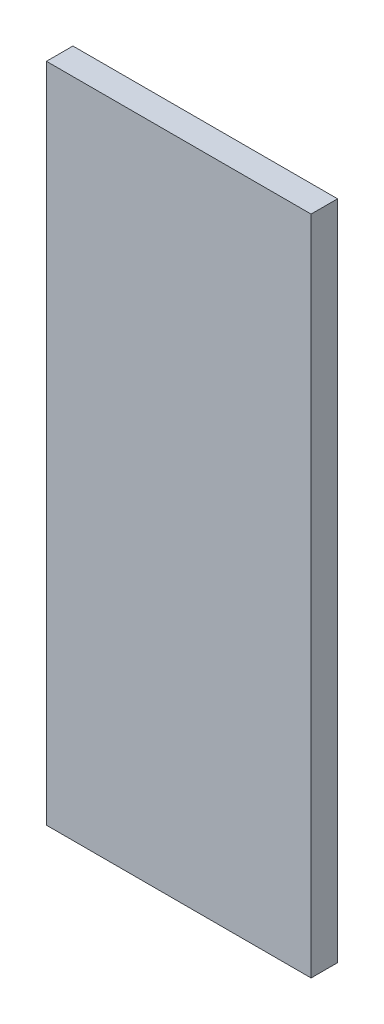
ISO-10303-21;
HEADER;
FILE_DESCRIPTION(('STEP AP214'),'2;1');
FILE_NAME('part.step','',(''),(''),'','','');
FILE_SCHEMA(('AUTOMOTIVE_DESIGN { 1 0 10303 214 1 1 1 1 }'));
ENDSEC;
DATA;
#1=APPLICATION_CONTEXT('core data for automotive mechanical design processes');
#2=APPLICATION_PROTOCOL_DEFINITION('international standard','automotive_design',2000,#1);
#3=PRODUCT_CONTEXT('',#1,'mechanical');
#4=PRODUCT('Part','Part','',(#3));
#5=PRODUCT_RELATED_PRODUCT_CATEGORY('part','',(#4));
#6=PRODUCT_DEFINITION_FORMATION('','',#4);
#7=PRODUCT_DEFINITION_CONTEXT('part definition',#1,'design');
#8=PRODUCT_DEFINITION('design','',#6,#7);
#9=PRODUCT_DEFINITION_SHAPE('','',#8);
#10=(LENGTH_UNIT() NAMED_UNIT(*) SI_UNIT(.MILLI.,.METRE.));
#11=(NAMED_UNIT(*) PLANE_ANGLE_UNIT() SI_UNIT($,.RADIAN.));
#12=(NAMED_UNIT(*) SI_UNIT($,.STERADIAN.) SOLID_ANGLE_UNIT());
#13=UNCERTAINTY_MEASURE_WITH_UNIT(LENGTH_MEASURE(1.E-05),#10,'distance_accuracy_value','');
#14=(GEOMETRIC_REPRESENTATION_CONTEXT(3) GLOBAL_UNCERTAINTY_ASSIGNED_CONTEXT((#13)) GLOBAL_UNIT_ASSIGNED_CONTEXT((#10,
#11,#12)) REPRESENTATION_CONTEXT('',''));
#15=CARTESIAN_POINT('',(0.,0.,0.));
#16=DIRECTION('',(0.,0.,1.));
#17=DIRECTION('',(1.,0.,0.));
#18=AXIS2_PLACEMENT_3D('',#15,#16,#17);
#19=CARTESIAN_POINT('',(6.,-15.,1.2));
#20=DIRECTION('',(-1.,0.,0.));
#21=DIRECTION('',(0.,0.,1.));
#22=AXIS2_PLACEMENT_3D('',#19,#20,#21);
#23=PLANE('',#22);
#24=DIRECTION('',(0.,1.,0.));
#25=VECTOR('',#24,1.);
#26=CARTESIAN_POINT('',(6.,-15.,0.));
#27=LINE('',#26,#25);
#28=CARTESIAN_POINT('',(6.,-15.,0.));
#29=VERTEX_POINT('',#28);
#30=CARTESIAN_POINT('',(6.,15.,0.));
#31=VERTEX_POINT('',#30);
#32=EDGE_CURVE('E123',#29,#31,#27,.T.);
#33=ORIENTED_EDGE('',*,*,#32,.T.);
#34=DIRECTION('',(0.,0.,-1.));
#35=VECTOR('',#34,1.);
#36=CARTESIAN_POINT('',(6.,15.,1.2));
#37=LINE('',#36,#35);
#38=CARTESIAN_POINT('',(6.,15.,1.2));
#39=VERTEX_POINT('',#38);
#40=EDGE_CURVE('E11',#39,#31,#37,.T.);
#41=ORIENTED_EDGE('',*,*,#40,.F.);
#42=DIRECTION('',(0.,1.,0.));
#43=VECTOR('',#42,1.);
#44=CARTESIAN_POINT('',(6.,-15.,1.2));
#45=LINE('',#44,#43);
#46=CARTESIAN_POINT('',(6.,-15.,1.2));
#47=VERTEX_POINT('',#46);
#48=EDGE_CURVE('E132',#47,#39,#45,.T.);
#49=ORIENTED_EDGE('',*,*,#48,.F.);
#50=DIRECTION('',(0.,0.,-1.));
#51=VECTOR('',#50,1.);
#52=CARTESIAN_POINT('',(6.,-15.,1.2));
#53=LINE('',#52,#51);
#54=EDGE_CURVE('E141',#47,#29,#53,.T.);
#55=ORIENTED_EDGE('',*,*,#54,.T.);
#56=EDGE_LOOP('',(#33,#41,#49,#55));
#57=FACE_BOUND('',#56,.T.);
#58=ADVANCED_FACE('F39',(#57),#23,.F.);
#59=CARTESIAN_POINT('',(-6.,15.,1.2));
#60=DIRECTION('',(0.,-1.,0.));
#61=DIRECTION('',(0.,0.,-1.));
#62=AXIS2_PLACEMENT_3D('',#59,#60,#61);
#63=PLANE('',#62);
#64=DIRECTION('',(-1.,0.,0.));
#65=VECTOR('',#64,1.);
#66=CARTESIAN_POINT('',(-6.,15.,0.));
#67=LINE('',#66,#65);
#68=CARTESIAN_POINT('',(-6.,15.,0.));
#69=VERTEX_POINT('',#68);
#70=EDGE_CURVE('E126',#31,#69,#67,.T.);
#71=ORIENTED_EDGE('',*,*,#70,.T.);
#72=DIRECTION('',(0.,0.,-1.));
#73=VECTOR('',#72,1.);
#74=CARTESIAN_POINT('',(-6.,15.,1.2));
#75=LINE('',#74,#73);
#76=CARTESIAN_POINT('',(-6.,15.,1.2));
#77=VERTEX_POINT('',#76);
#78=EDGE_CURVE('E46',#77,#69,#75,.T.);
#79=ORIENTED_EDGE('',*,*,#78,.F.);
#80=DIRECTION('',(-1.,0.,0.));
#81=VECTOR('',#80,1.);
#82=CARTESIAN_POINT('',(-6.,15.,1.2));
#83=LINE('',#82,#81);
#84=EDGE_CURVE('E135',#39,#77,#83,.T.);
#85=ORIENTED_EDGE('',*,*,#84,.F.);
#86=ORIENTED_EDGE('',*,*,#40,.T.);
#87=EDGE_LOOP('',(#71,#79,#85,#86));
#88=FACE_BOUND('',#87,.T.);
#89=ADVANCED_FACE('F172',(#88),#63,.F.);
#90=CARTESIAN_POINT('',(-6.,-15.,1.2));
#91=DIRECTION('',(1.,0.,0.));
#92=DIRECTION('',(0.,0.,-1.));
#93=AXIS2_PLACEMENT_3D('',#90,#91,#92);
#94=PLANE('',#93);
#95=DIRECTION('',(0.,-1.,0.));
#96=VECTOR('',#95,1.);
#97=CARTESIAN_POINT('',(-6.,-15.,0.));
#98=LINE('',#97,#96);
#99=CARTESIAN_POINT('',(-6.,-15.,0.));
#100=VERTEX_POINT('',#99);
#101=EDGE_CURVE('E144',#69,#100,#98,.T.);
#102=ORIENTED_EDGE('',*,*,#101,.T.);
#103=DIRECTION('',(0.,0.,-1.));
#104=VECTOR('',#103,1.);
#105=CARTESIAN_POINT('',(-6.,-15.,1.2));
#106=LINE('',#105,#104);
#107=CARTESIAN_POINT('',(-6.,-15.,1.2));
#108=VERTEX_POINT('',#107);
#109=EDGE_CURVE('E149',#108,#100,#106,.T.);
#110=ORIENTED_EDGE('',*,*,#109,.F.);
#111=DIRECTION('',(0.,-1.,0.));
#112=VECTOR('',#111,1.);
#113=CARTESIAN_POINT('',(-6.,-15.,1.2));
#114=LINE('',#113,#112);
#115=EDGE_CURVE('E138',#77,#108,#114,.T.);
#116=ORIENTED_EDGE('',*,*,#115,.F.);
#117=ORIENTED_EDGE('',*,*,#78,.T.);
#118=EDGE_LOOP('',(#102,#110,#116,#117));
#119=FACE_BOUND('',#118,.T.);
#120=ADVANCED_FACE('F156',(#119),#94,.F.);
#121=CARTESIAN_POINT('',(-6.,-15.,1.2));
#122=DIRECTION('',(0.,1.,0.));
#123=DIRECTION('',(0.,0.,1.));
#124=AXIS2_PLACEMENT_3D('',#121,#122,#123);
#125=PLANE('',#124);
#126=DIRECTION('',(1.,0.,0.));
#127=VECTOR('',#126,1.);
#128=CARTESIAN_POINT('',(-6.,-15.,0.));
#129=LINE('',#128,#127);
#130=EDGE_CURVE('E136',#100,#29,#129,.T.);
#131=ORIENTED_EDGE('',*,*,#130,.T.);
#132=ORIENTED_EDGE('',*,*,#54,.F.);
#133=DIRECTION('',(1.,0.,0.));
#134=VECTOR('',#133,1.);
#135=CARTESIAN_POINT('',(-6.,-15.,1.2));
#136=LINE('',#135,#134);
#137=EDGE_CURVE('E140',#108,#47,#136,.T.);
#138=ORIENTED_EDGE('',*,*,#137,.F.);
#139=ORIENTED_EDGE('',*,*,#109,.T.);
#140=EDGE_LOOP('',(#131,#132,#138,#139));
#141=FACE_BOUND('',#140,.T.);
#142=ADVANCED_FACE('F165',(#141),#125,.F.);
#143=CARTESIAN_POINT('',(0.,0.,1.2));
#144=DIRECTION('',(0.,0.,-1.));
#145=DIRECTION('',(-1.,0.,0.));
#146=AXIS2_PLACEMENT_3D('',#143,#144,#145);
#147=PLANE('',#146);
#148=ORIENTED_EDGE('',*,*,#48,.T.);
#149=ORIENTED_EDGE('',*,*,#84,.T.);
#150=ORIENTED_EDGE('',*,*,#115,.T.);
#151=ORIENTED_EDGE('',*,*,#137,.T.);
#152=EDGE_LOOP('',(#148,#149,#150,#151));
#153=FACE_BOUND('',#152,.T.);
#154=ADVANCED_FACE('F171',(#153),#147,.F.);
#155=CARTESIAN_POINT('',(0.,0.,0.));
#156=DIRECTION('',(0.,0.,-1.));
#157=DIRECTION('',(-1.,0.,0.));
#158=AXIS2_PLACEMENT_3D('',#155,#156,#157);
#159=PLANE('',#158);
#160=DIRECTION('',(0.,1.,0.));
#161=VECTOR('',#160,1.);
#162=CARTESIAN_POINT('',(-2.,-2.5,0.));
#163=LINE('',#162,#161);
#164=CARTESIAN_POINT('',(-2.,-2.5,0.));
#165=VERTEX_POINT('',#164);
#166=CARTESIAN_POINT('',(-2.,2.5,0.));
#167=VERTEX_POINT('',#166);
#168=EDGE_CURVE('E53',#165,#167,#163,.T.);
#169=ORIENTED_EDGE('',*,*,#168,.F.);
#170=DIRECTION('',(-1.,0.,0.));
#171=VECTOR('',#170,1.);
#172=CARTESIAN_POINT('',(2.,-2.5,0.));
#173=LINE('',#172,#171);
#174=CARTESIAN_POINT('',(2.,-2.5,0.));
#175=VERTEX_POINT('',#174);
#176=EDGE_CURVE('E57',#175,#165,#173,.T.);
#177=ORIENTED_EDGE('',*,*,#176,.F.);
#178=DIRECTION('',(0.,-1.,0.));
#179=VECTOR('',#178,1.);
#180=CARTESIAN_POINT('',(2.,-2.5,0.));
#181=LINE('',#180,#179);
#182=CARTESIAN_POINT('',(2.,2.5,0.));
#183=VERTEX_POINT('',#182);
#184=EDGE_CURVE('E288',#183,#175,#181,.T.);
#185=ORIENTED_EDGE('',*,*,#184,.F.);
#186=DIRECTION('',(1.,0.,0.));
#187=VECTOR('',#186,1.);
#188=CARTESIAN_POINT('',(2.,2.5,0.));
#189=LINE('',#188,#187);
#190=EDGE_CURVE('E294',#167,#183,#189,.T.);
#191=ORIENTED_EDGE('',*,*,#190,.F.);
#192=EDGE_LOOP('',(#169,#177,#185,#191));
#193=FACE_BOUND('',#192,.T.);
#194=ORIENTED_EDGE('',*,*,#32,.F.);
#195=ORIENTED_EDGE('',*,*,#130,.F.);
#196=ORIENTED_EDGE('',*,*,#101,.F.);
#197=ORIENTED_EDGE('',*,*,#70,.F.);
#198=EDGE_LOOP('',(#194,#195,#196,#197));
#199=FACE_BOUND('',#198,.T.);
#200=ADVANCED_FACE('F162',(#193,#199),#159,.T.);
#201=CARTESIAN_POINT('',(-2.,-2.5,-2.));
#202=DIRECTION('',(1.,0.,0.));
#203=DIRECTION('',(0.,0.,-1.));
#204=AXIS2_PLACEMENT_3D('',#201,#202,#203);
#205=PLANE('',#204);
#206=ORIENTED_EDGE('',*,*,#168,.T.);
#207=DIRECTION('',(0.,0.,1.));
#208=VECTOR('',#207,1.);
#209=CARTESIAN_POINT('',(-2.,2.5,-2.));
#210=LINE('',#209,#208);
#211=CARTESIAN_POINT('',(-2.,2.5,-2.));
#212=VERTEX_POINT('',#211);
#213=EDGE_CURVE('E106',#212,#167,#210,.T.);
#214=ORIENTED_EDGE('',*,*,#213,.F.);
#215=DIRECTION('',(0.,1.,0.));
#216=VECTOR('',#215,1.);
#217=CARTESIAN_POINT('',(-2.,-2.5,-2.));
#218=LINE('',#217,#216);
#219=CARTESIAN_POINT('',(-2.,-2.5,-2.));
#220=VERTEX_POINT('',#219);
#221=EDGE_CURVE('E112',#220,#212,#218,.T.);
#222=ORIENTED_EDGE('',*,*,#221,.F.);
#223=DIRECTION('',(0.,0.,1.));
#224=VECTOR('',#223,1.);
#225=CARTESIAN_POINT('',(-2.,-2.5,-2.));
#226=LINE('',#225,#224);
#227=EDGE_CURVE('E286',#220,#165,#226,.T.);
#228=ORIENTED_EDGE('',*,*,#227,.T.);
#229=EDGE_LOOP('',(#206,#214,#222,#228));
#230=FACE_BOUND('',#229,.T.);
#231=ADVANCED_FACE('F122',(#230),#205,.F.);
#232=CARTESIAN_POINT('',(2.,2.5,-2.));
#233=DIRECTION('',(0.,-1.,0.));
#234=DIRECTION('',(0.,0.,-1.));
#235=AXIS2_PLACEMENT_3D('',#232,#233,#234);
#236=PLANE('',#235);
#237=ORIENTED_EDGE('',*,*,#190,.T.);
#238=DIRECTION('',(0.,0.,1.));
#239=VECTOR('',#238,1.);
#240=CARTESIAN_POINT('',(2.,2.5,-2.));
#241=LINE('',#240,#239);
#242=CARTESIAN_POINT('',(2.,2.5,-2.));
#243=VERTEX_POINT('',#242);
#244=EDGE_CURVE('E108',#243,#183,#241,.T.);
#245=ORIENTED_EDGE('',*,*,#244,.F.);
#246=DIRECTION('',(1.,0.,0.));
#247=VECTOR('',#246,1.);
#248=CARTESIAN_POINT('',(2.,2.5,-2.));
#249=LINE('',#248,#247);
#250=EDGE_CURVE('E101',#212,#243,#249,.T.);
#251=ORIENTED_EDGE('',*,*,#250,.F.);
#252=ORIENTED_EDGE('',*,*,#213,.T.);
#253=EDGE_LOOP('',(#237,#245,#251,#252));
#254=FACE_BOUND('',#253,.T.);
#255=ADVANCED_FACE('F104',(#254),#236,.F.);
#256=CARTESIAN_POINT('',(2.,-2.5,-2.));
#257=DIRECTION('',(-1.,0.,0.));
#258=DIRECTION('',(0.,0.,1.));
#259=AXIS2_PLACEMENT_3D('',#256,#257,#258);
#260=PLANE('',#259);
#261=ORIENTED_EDGE('',*,*,#184,.T.);
#262=DIRECTION('',(0.,0.,1.));
#263=VECTOR('',#262,1.);
#264=CARTESIAN_POINT('',(2.,-2.5,-2.));
#265=LINE('',#264,#263);
#266=CARTESIAN_POINT('',(2.,-2.5,-2.));
#267=VERTEX_POINT('',#266);
#268=EDGE_CURVE('E128',#267,#175,#265,.T.);
#269=ORIENTED_EDGE('',*,*,#268,.F.);
#270=DIRECTION('',(0.,-1.,0.));
#271=VECTOR('',#270,1.);
#272=CARTESIAN_POINT('',(2.,-2.5,-2.));
#273=LINE('',#272,#271);
#274=EDGE_CURVE('E111',#243,#267,#273,.T.);
#275=ORIENTED_EDGE('',*,*,#274,.F.);
#276=ORIENTED_EDGE('',*,*,#244,.T.);
#277=EDGE_LOOP('',(#261,#269,#275,#276));
#278=FACE_BOUND('',#277,.T.);
#279=ADVANCED_FACE('F190',(#278),#260,.F.);
#280=CARTESIAN_POINT('',(2.,-2.5,-2.));
#281=DIRECTION('',(0.,1.,0.));
#282=DIRECTION('',(0.,0.,1.));
#283=AXIS2_PLACEMENT_3D('',#280,#281,#282);
#284=PLANE('',#283);
#285=ORIENTED_EDGE('',*,*,#176,.T.);
#286=ORIENTED_EDGE('',*,*,#227,.F.);
#287=DIRECTION('',(-1.,0.,0.));
#288=VECTOR('',#287,1.);
#289=CARTESIAN_POINT('',(2.,-2.5,-2.));
#290=LINE('',#289,#288);
#291=EDGE_CURVE('E117',#267,#220,#290,.T.);
#292=ORIENTED_EDGE('',*,*,#291,.F.);
#293=ORIENTED_EDGE('',*,*,#268,.T.);
#294=EDGE_LOOP('',(#285,#286,#292,#293));
#295=FACE_BOUND('',#294,.T.);
#296=ADVANCED_FACE('F193',(#295),#284,.F.);
#297=CARTESIAN_POINT('',(0.,0.,-2.));
#298=DIRECTION('',(0.,0.,1.));
#299=DIRECTION('',(1.,0.,0.));
#300=AXIS2_PLACEMENT_3D('',#297,#298,#299);
#301=PLANE('',#300);
#302=ORIENTED_EDGE('',*,*,#221,.T.);
#303=ORIENTED_EDGE('',*,*,#250,.T.);
#304=ORIENTED_EDGE('',*,*,#274,.T.);
#305=ORIENTED_EDGE('',*,*,#291,.T.);
#306=EDGE_LOOP('',(#302,#303,#304,#305));
#307=FACE_BOUND('',#306,.T.);
#308=ADVANCED_FACE('F115',(#307),#301,.F.);
#309=CLOSED_SHELL('',(#58,#89,#120,#142,#154,#200,#231,#255,#279,#296,#308));
#310=MANIFOLD_SOLID_BREP('B2',#309);
#311=ADVANCED_BREP_SHAPE_REPRESENTATION('',(#18,#310),#14);
#312=SHAPE_DEFINITION_REPRESENTATION(#9,#311);
ENDSEC;
END-ISO-10303-21;
